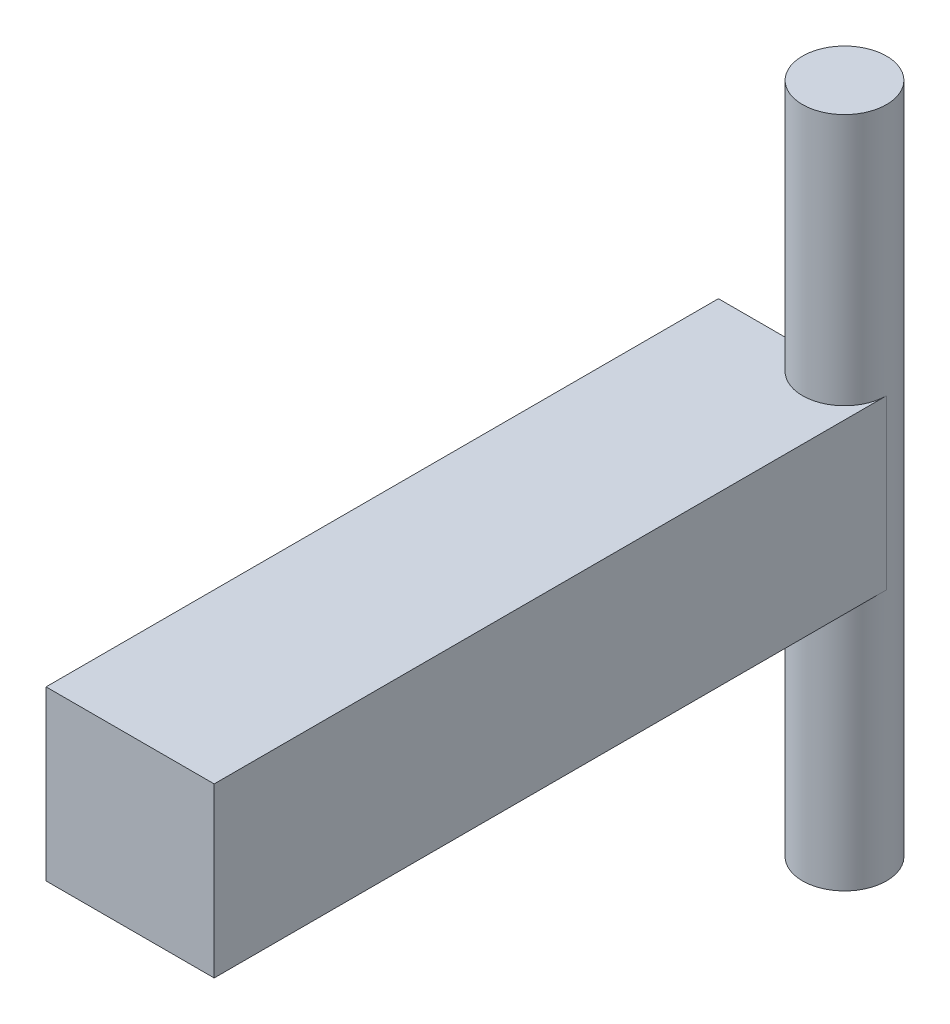
ISO-10303-21;
HEADER;
FILE_DESCRIPTION(('STEP AP214'),'2;1');
FILE_NAME('part.step','',(''),(''),'','','');
FILE_SCHEMA(('AUTOMOTIVE_DESIGN { 1 0 10303 214 1 1 1 1 }'));
ENDSEC;
DATA;
#1=APPLICATION_CONTEXT('core data for automotive mechanical design processes');
#2=APPLICATION_PROTOCOL_DEFINITION('international standard','automotive_design',2000,#1);
#3=PRODUCT_CONTEXT('',#1,'mechanical');
#4=PRODUCT('Part','Part','',(#3));
#5=PRODUCT_RELATED_PRODUCT_CATEGORY('part','',(#4));
#6=PRODUCT_DEFINITION_FORMATION('','',#4);
#7=PRODUCT_DEFINITION_CONTEXT('part definition',#1,'design');
#8=PRODUCT_DEFINITION('design','',#6,#7);
#9=PRODUCT_DEFINITION_SHAPE('','',#8);
#10=(LENGTH_UNIT() NAMED_UNIT(*) SI_UNIT(.MILLI.,.METRE.));
#11=(NAMED_UNIT(*) PLANE_ANGLE_UNIT() SI_UNIT($,.RADIAN.));
#12=(NAMED_UNIT(*) SI_UNIT($,.STERADIAN.) SOLID_ANGLE_UNIT());
#13=UNCERTAINTY_MEASURE_WITH_UNIT(LENGTH_MEASURE(1.E-05),#10,'distance_accuracy_value','');
#14=(GEOMETRIC_REPRESENTATION_CONTEXT(3) GLOBAL_UNCERTAINTY_ASSIGNED_CONTEXT((#13)) GLOBAL_UNIT_ASSIGNED_CONTEXT((#10,
#11,#12)) REPRESENTATION_CONTEXT('',''));
#15=CARTESIAN_POINT('',(0.,0.,0.));
#16=DIRECTION('',(0.,0.,1.));
#17=DIRECTION('',(1.,0.,0.));
#18=AXIS2_PLACEMENT_3D('',#15,#16,#17);
#19=CARTESIAN_POINT('',(0.,0.,0.));
#20=DIRECTION('',(0.,0.,1.));
#21=DIRECTION('',(1.,0.,0.));
#22=AXIS2_PLACEMENT_3D('',#19,#20,#21);
#23=PLANE('',#22);
#24=DIRECTION('',(0.,-1.,0.));
#25=VECTOR('',#24,1.);
#26=CARTESIAN_POINT('',(0.,8.,0.));
#27=LINE('',#26,#25);
#28=CARTESIAN_POINT('',(0.,-2.,0.));
#29=VERTEX_POINT('',#28);
#30=CARTESIAN_POINT('',(0.,2.,0.));
#31=VERTEX_POINT('',#30);
#32=EDGE_CURVE('E11',#29,#31,#27,.F.);
#33=ORIENTED_EDGE('',*,*,#32,.F.);
#34=DIRECTION('',(1.,0.,0.));
#35=VECTOR('',#34,1.);
#36=CARTESIAN_POINT('',(-2.,-2.,0.));
#37=LINE('',#36,#35);
#38=CARTESIAN_POINT('',(-2.,-2.,0.));
#39=VERTEX_POINT('',#38);
#40=EDGE_CURVE('E97',#39,#29,#37,.T.);
#41=ORIENTED_EDGE('',*,*,#40,.F.);
#42=DIRECTION('',(0.,-1.,0.));
#43=VECTOR('',#42,1.);
#44=CARTESIAN_POINT('',(-2.,2.,0.));
#45=LINE('',#44,#43);
#46=CARTESIAN_POINT('',(-2.,2.,0.));
#47=VERTEX_POINT('',#46);
#48=EDGE_CURVE('E103',#47,#39,#45,.T.);
#49=ORIENTED_EDGE('',*,*,#48,.F.);
#50=DIRECTION('',(-1.,0.,0.));
#51=VECTOR('',#50,1.);
#52=CARTESIAN_POINT('',(-2.,2.,0.));
#53=LINE('',#52,#51);
#54=EDGE_CURVE('E73',#31,#47,#53,.T.);
#55=ORIENTED_EDGE('',*,*,#54,.F.);
#56=EDGE_LOOP('',(#33,#41,#49,#55));
#57=FACE_BOUND('',#56,.T.);
#58=ADVANCED_FACE('F36',(#57),#23,.F.);
#59=CARTESIAN_POINT('',(-2.,2.,16.));
#60=DIRECTION('',(1.,0.,0.));
#61=DIRECTION('',(0.,1.,0.));
#62=AXIS2_PLACEMENT_3D('',#59,#60,#61);
#63=PLANE('',#62);
#64=ORIENTED_EDGE('',*,*,#48,.T.);
#65=DIRECTION('',(0.,0.,-1.));
#66=VECTOR('',#65,1.);
#67=CARTESIAN_POINT('',(-2.,-2.,16.));
#68=LINE('',#67,#66);
#69=CARTESIAN_POINT('',(-2.,-2.,16.));
#70=VERTEX_POINT('',#69);
#71=EDGE_CURVE('E45',#70,#39,#68,.T.);
#72=ORIENTED_EDGE('',*,*,#71,.F.);
#73=DIRECTION('',(0.,-1.,0.));
#74=VECTOR('',#73,1.);
#75=CARTESIAN_POINT('',(-2.,2.,16.));
#76=LINE('',#75,#74);
#77=CARTESIAN_POINT('',(-2.,2.,16.));
#78=VERTEX_POINT('',#77);
#79=EDGE_CURVE('E113',#78,#70,#76,.T.);
#80=ORIENTED_EDGE('',*,*,#79,.F.);
#81=DIRECTION('',(0.,0.,-1.));
#82=VECTOR('',#81,1.);
#83=CARTESIAN_POINT('',(-2.,2.,16.));
#84=LINE('',#83,#82);
#85=EDGE_CURVE('E109',#78,#47,#84,.T.);
#86=ORIENTED_EDGE('',*,*,#85,.T.);
#87=EDGE_LOOP('',(#64,#72,#80,#86));
#88=FACE_BOUND('',#87,.T.);
#89=ADVANCED_FACE('F38',(#88),#63,.F.);
#90=CARTESIAN_POINT('',(-2.,-2.,16.));
#91=DIRECTION('',(0.,1.,0.));
#92=DIRECTION('',(0.,0.,1.));
#93=AXIS2_PLACEMENT_3D('',#90,#91,#92);
#94=PLANE('',#93);
#95=CARTESIAN_POINT('',(1.,-2.,0.));
#96=DIRECTION('',(0.,1.,0.));
#97=DIRECTION('',(0.,0.,1.));
#98=AXIS2_PLACEMENT_3D('',#95,#96,#97);
#99=CIRCLE('',#98,1.);
#100=CARTESIAN_POINT('',(2.,-2.,0.));
#101=VERTEX_POINT('',#100);
#102=EDGE_CURVE('E91',#101,#29,#99,.F.);
#103=ORIENTED_EDGE('',*,*,#102,.F.);
#104=DIRECTION('',(0.,0.,-1.));
#105=VECTOR('',#104,1.);
#106=CARTESIAN_POINT('',(2.,-2.,16.));
#107=LINE('',#106,#105);
#108=CARTESIAN_POINT('',(2.,-2.,16.));
#109=VERTEX_POINT('',#108);
#110=EDGE_CURVE('E101',#109,#101,#107,.T.);
#111=ORIENTED_EDGE('',*,*,#110,.F.);
#112=DIRECTION('',(1.,0.,0.));
#113=VECTOR('',#112,1.);
#114=CARTESIAN_POINT('',(-2.,-2.,16.));
#115=LINE('',#114,#113);
#116=EDGE_CURVE('E81',#70,#109,#115,.T.);
#117=ORIENTED_EDGE('',*,*,#116,.F.);
#118=ORIENTED_EDGE('',*,*,#71,.T.);
#119=ORIENTED_EDGE('',*,*,#40,.T.);
#120=EDGE_LOOP('',(#103,#111,#117,#118,#119));
#121=FACE_BOUND('',#120,.T.);
#122=ADVANCED_FACE('F100',(#121),#94,.F.);
#123=CARTESIAN_POINT('',(2.,2.,16.));
#124=DIRECTION('',(-1.,0.,0.));
#125=DIRECTION('',(0.,-1.,0.));
#126=AXIS2_PLACEMENT_3D('',#123,#124,#125);
#127=PLANE('',#126);
#128=DIRECTION('',(0.,1.,0.));
#129=VECTOR('',#128,1.);
#130=CARTESIAN_POINT('',(2.,2.,0.));
#131=LINE('',#130,#129);
#132=CARTESIAN_POINT('',(2.,2.,0.));
#133=VERTEX_POINT('',#132);
#134=EDGE_CURVE('E88',#101,#133,#131,.T.);
#135=ORIENTED_EDGE('',*,*,#134,.T.);
#136=DIRECTION('',(0.,0.,-1.));
#137=VECTOR('',#136,1.);
#138=CARTESIAN_POINT('',(2.,2.,16.));
#139=LINE('',#138,#137);
#140=CARTESIAN_POINT('',(2.,2.,16.));
#141=VERTEX_POINT('',#140);
#142=EDGE_CURVE('E107',#141,#133,#139,.T.);
#143=ORIENTED_EDGE('',*,*,#142,.F.);
#144=DIRECTION('',(0.,1.,0.));
#145=VECTOR('',#144,1.);
#146=CARTESIAN_POINT('',(2.,2.,16.));
#147=LINE('',#146,#145);
#148=EDGE_CURVE('E106',#109,#141,#147,.T.);
#149=ORIENTED_EDGE('',*,*,#148,.F.);
#150=ORIENTED_EDGE('',*,*,#110,.T.);
#151=EDGE_LOOP('',(#135,#143,#149,#150));
#152=FACE_BOUND('',#151,.T.);
#153=ADVANCED_FACE('F105',(#152),#127,.F.);
#154=CARTESIAN_POINT('',(-2.,2.,16.));
#155=DIRECTION('',(0.,-1.,0.));
#156=DIRECTION('',(0.,0.,-1.));
#157=AXIS2_PLACEMENT_3D('',#154,#155,#156);
#158=PLANE('',#157);
#159=CARTESIAN_POINT('',(1.,2.,0.));
#160=DIRECTION('',(0.,-1.,0.));
#161=DIRECTION('',(0.,0.,-1.));
#162=AXIS2_PLACEMENT_3D('',#159,#160,#161);
#163=CIRCLE('',#162,1.);
#164=EDGE_CURVE('E67',#31,#133,#163,.F.);
#165=ORIENTED_EDGE('',*,*,#164,.F.);
#166=ORIENTED_EDGE('',*,*,#54,.T.);
#167=ORIENTED_EDGE('',*,*,#85,.F.);
#168=DIRECTION('',(-1.,0.,0.));
#169=VECTOR('',#168,1.);
#170=CARTESIAN_POINT('',(-2.,2.,16.));
#171=LINE('',#170,#169);
#172=EDGE_CURVE('E53',#141,#78,#171,.T.);
#173=ORIENTED_EDGE('',*,*,#172,.F.);
#174=ORIENTED_EDGE('',*,*,#142,.T.);
#175=EDGE_LOOP('',(#165,#166,#167,#173,#174));
#176=FACE_BOUND('',#175,.T.);
#177=ADVANCED_FACE('F154',(#176),#158,.F.);
#178=CARTESIAN_POINT('',(0.,0.,16.));
#179=DIRECTION('',(0.,0.,1.));
#180=DIRECTION('',(1.,0.,0.));
#181=AXIS2_PLACEMENT_3D('',#178,#179,#180);
#182=PLANE('',#181);
#183=ORIENTED_EDGE('',*,*,#79,.T.);
#184=ORIENTED_EDGE('',*,*,#116,.T.);
#185=ORIENTED_EDGE('',*,*,#148,.T.);
#186=ORIENTED_EDGE('',*,*,#172,.T.);
#187=EDGE_LOOP('',(#183,#184,#185,#186));
#188=FACE_BOUND('',#187,.T.);
#189=ADVANCED_FACE('F134',(#188),#182,.T.);
#190=CARTESIAN_POINT('',(1.,8.,0.));
#191=DIRECTION('',(0.,-1.,0.));
#192=DIRECTION('',(0.,0.,-1.));
#193=AXIS2_PLACEMENT_3D('',#190,#191,#192);
#194=CYLINDRICAL_SURFACE('',#193,1.);
#195=CARTESIAN_POINT('',(1.,8.,0.));
#196=DIRECTION('',(0.,1.,0.));
#197=DIRECTION('',(0.,0.,1.));
#198=AXIS2_PLACEMENT_3D('',#195,#196,#197);
#199=CIRCLE('',#198,1.);
#200=CARTESIAN_POINT('',(1.,8.,1.));
#201=VERTEX_POINT('',#200);
#202=EDGE_CURVE('E123',#201,#201,#199,.T.);
#203=ORIENTED_EDGE('',*,*,#202,.F.);
#204=EDGE_LOOP('',(#203));
#205=FACE_BOUND('',#204,.T.);
#206=CARTESIAN_POINT('',(1.,-8.,0.));
#207=DIRECTION('',(0.,1.,0.));
#208=DIRECTION('',(0.,0.,1.));
#209=AXIS2_PLACEMENT_3D('',#206,#207,#208);
#210=CIRCLE('',#209,1.);
#211=CARTESIAN_POINT('',(1.,-8.,1.));
#212=VERTEX_POINT('',#211);
#213=EDGE_CURVE('E124',#212,#212,#210,.T.);
#214=ORIENTED_EDGE('',*,*,#213,.T.);
#215=EDGE_LOOP('',(#214));
#216=FACE_BOUND('',#215,.T.);
#217=ORIENTED_EDGE('',*,*,#134,.F.);
#218=ORIENTED_EDGE('',*,*,#102,.T.);
#219=ORIENTED_EDGE('',*,*,#32,.T.);
#220=ORIENTED_EDGE('',*,*,#164,.T.);
#221=EDGE_LOOP('',(#217,#218,#219,#220));
#222=FACE_BOUND('',#221,.T.);
#223=ADVANCED_FACE('F90',(#205,#216,#222),#194,.T.);
#224=CARTESIAN_POINT('',(1.,8.,0.));
#225=DIRECTION('',(0.,1.,0.));
#226=DIRECTION('',(0.,0.,1.));
#227=AXIS2_PLACEMENT_3D('',#224,#225,#226);
#228=PLANE('',#227);
#229=ORIENTED_EDGE('',*,*,#202,.T.);
#230=EDGE_LOOP('',(#229));
#231=FACE_BOUND('',#230,.T.);
#232=ADVANCED_FACE('F130',(#231),#228,.T.);
#233=CARTESIAN_POINT('',(1.,-8.,0.));
#234=DIRECTION('',(0.,1.,0.));
#235=DIRECTION('',(0.,0.,1.));
#236=AXIS2_PLACEMENT_3D('',#233,#234,#235);
#237=PLANE('',#236);
#238=ORIENTED_EDGE('',*,*,#213,.F.);
#239=EDGE_LOOP('',(#238));
#240=FACE_BOUND('',#239,.T.);
#241=ADVANCED_FACE('F138',(#240),#237,.F.);
#242=CLOSED_SHELL('',(#58,#89,#122,#153,#177,#189,#223,#232,#241));
#243=MANIFOLD_SOLID_BREP('B2',#242);
#244=ADVANCED_BREP_SHAPE_REPRESENTATION('',(#18,#243),#14);
#245=SHAPE_DEFINITION_REPRESENTATION(#9,#244);
ENDSEC;
END-ISO-10303-21;
